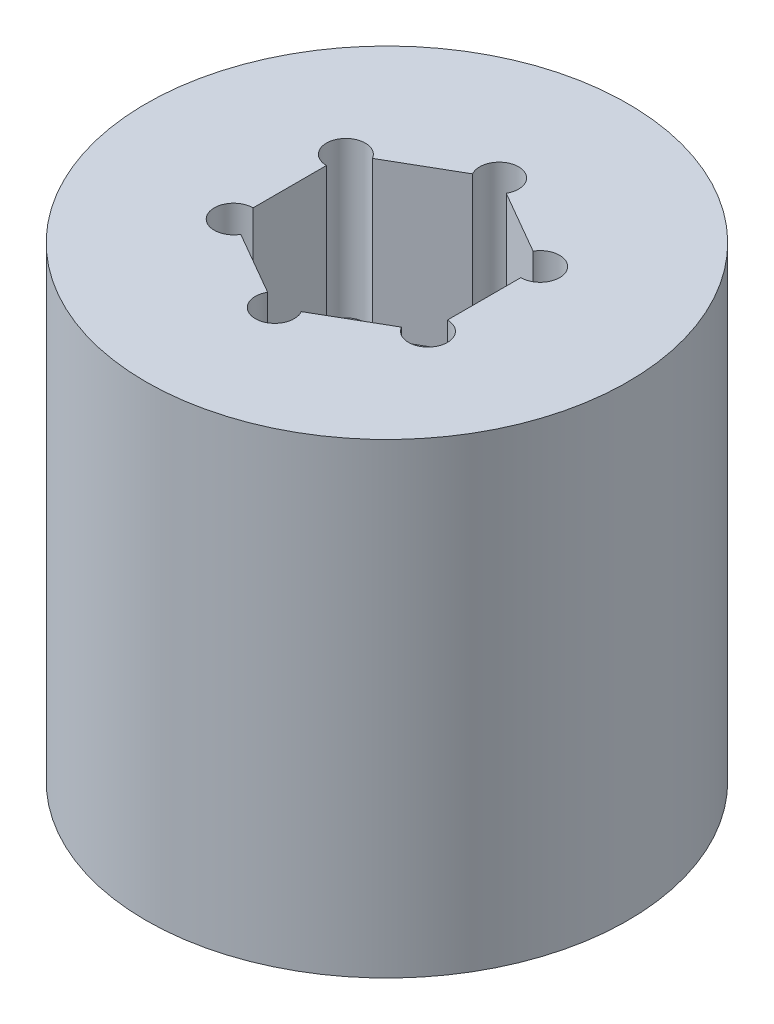
ISO-10303-21;
HEADER;
FILE_DESCRIPTION(('STEP AP214'),'2;1');
FILE_NAME('part.step','',(''),(''),'','','');
FILE_SCHEMA(('AUTOMOTIVE_DESIGN { 1 0 10303 214 1 1 1 1 }'));
ENDSEC;
DATA;
#1=APPLICATION_CONTEXT('core data for automotive mechanical design processes');
#2=APPLICATION_PROTOCOL_DEFINITION('international standard','automotive_design',2000,#1);
#3=PRODUCT_CONTEXT('',#1,'mechanical');
#4=PRODUCT('Part','Part','',(#3));
#5=PRODUCT_RELATED_PRODUCT_CATEGORY('part','',(#4));
#6=PRODUCT_DEFINITION_FORMATION('','',#4);
#7=PRODUCT_DEFINITION_CONTEXT('part definition',#1,'design');
#8=PRODUCT_DEFINITION('design','',#6,#7);
#9=PRODUCT_DEFINITION_SHAPE('','',#8);
#10=(LENGTH_UNIT() NAMED_UNIT(*) SI_UNIT(.MILLI.,.METRE.));
#11=(NAMED_UNIT(*) PLANE_ANGLE_UNIT() SI_UNIT($,.RADIAN.));
#12=(NAMED_UNIT(*) SI_UNIT($,.STERADIAN.) SOLID_ANGLE_UNIT());
#13=UNCERTAINTY_MEASURE_WITH_UNIT(LENGTH_MEASURE(1.E-05),#10,'distance_accuracy_value','');
#14=(GEOMETRIC_REPRESENTATION_CONTEXT(3) GLOBAL_UNCERTAINTY_ASSIGNED_CONTEXT((#13)) GLOBAL_UNIT_ASSIGNED_CONTEXT((#10,
#11,#12)) REPRESENTATION_CONTEXT('',''));
#15=CARTESIAN_POINT('',(0.,0.,0.));
#16=DIRECTION('',(0.,0.,1.));
#17=DIRECTION('',(1.,0.,0.));
#18=AXIS2_PLACEMENT_3D('',#15,#16,#17);
#19=CARTESIAN_POINT('',(0.,19.05,0.));
#20=DIRECTION('',(0.,-1.,0.));
#21=DIRECTION('',(0.,0.,-1.));
#22=AXIS2_PLACEMENT_3D('',#19,#20,#21);
#23=CYLINDRICAL_SURFACE('',#22,19.685);
#24=CARTESIAN_POINT('',(0.,19.05,0.));
#25=DIRECTION('',(0.,1.,0.));
#26=DIRECTION('',(0.,0.,1.));
#27=AXIS2_PLACEMENT_3D('',#24,#25,#26);
#28=CIRCLE('',#27,19.685);
#29=CARTESIAN_POINT('',(0.,19.05,19.685));
#30=VERTEX_POINT('',#29);
#31=EDGE_CURVE('E11',#30,#30,#28,.T.);
#32=ORIENTED_EDGE('',*,*,#31,.F.);
#33=EDGE_LOOP('',(#32));
#34=FACE_BOUND('',#33,.T.);
#35=CARTESIAN_POINT('',(0.,-19.05,0.));
#36=DIRECTION('',(0.,1.,0.));
#37=DIRECTION('',(0.,0.,1.));
#38=AXIS2_PLACEMENT_3D('',#35,#36,#37);
#39=CIRCLE('',#38,19.685);
#40=CARTESIAN_POINT('',(0.,-19.05,19.685));
#41=VERTEX_POINT('',#40);
#42=EDGE_CURVE('E42',#41,#41,#39,.T.);
#43=ORIENTED_EDGE('',*,*,#42,.T.);
#44=EDGE_LOOP('',(#43));
#45=FACE_BOUND('',#44,.T.);
#46=ADVANCED_FACE('F39',(#34,#45),#23,.T.);
#47=CARTESIAN_POINT('',(0.,19.05,0.));
#48=DIRECTION('',(0.,1.,0.));
#49=DIRECTION('',(0.,0.,1.));
#50=AXIS2_PLACEMENT_3D('',#47,#48,#49);
#51=PLANE('',#50);
#52=CARTESIAN_POINT('',(7.9375,19.05,-4.58271776169266));
#53=DIRECTION('',(0.,1.,0.));
#54=DIRECTION('',(0.,0.,1.));
#55=AXIS2_PLACEMENT_3D('',#52,#53,#54);
#56=CIRCLE('',#55,1.5875);
#57=CARTESIAN_POINT('',(7.9375,19.05,-2.99521776169266));
#58=VERTEX_POINT('',#57);
#59=CARTESIAN_POINT('',(6.5626846714922,19.05,-5.37646776169266));
#60=VERTEX_POINT('',#59);
#61=EDGE_CURVE('E54',#58,#60,#56,.T.);
#62=ORIENTED_EDGE('',*,*,#61,.F.);
#63=DIRECTION('',(0.,0.,-1.));
#64=VECTOR('',#63,1.);
#65=CARTESIAN_POINT('',(7.9375,19.05,0.));
#66=LINE('',#65,#64);
#67=CARTESIAN_POINT('',(7.9375,19.05,2.99521776169266));
#68=VERTEX_POINT('',#67);
#69=EDGE_CURVE('E200',#68,#58,#66,.T.);
#70=ORIENTED_EDGE('',*,*,#69,.F.);
#71=CARTESIAN_POINT('',(7.9375,19.05,4.58271776169266));
#72=DIRECTION('',(0.,1.,0.));
#73=DIRECTION('',(0.,0.,1.));
#74=AXIS2_PLACEMENT_3D('',#71,#72,#73);
#75=CIRCLE('',#74,1.5875);
#76=CARTESIAN_POINT('',(6.5626846714922,19.05,5.37646776169266));
#77=VERTEX_POINT('',#76);
#78=EDGE_CURVE('E204',#77,#68,#75,.T.);
#79=ORIENTED_EDGE('',*,*,#78,.F.);
#80=DIRECTION('',(0.866025403784439,0.,-0.5));
#81=VECTOR('',#80,1.);
#82=CARTESIAN_POINT('',(3.96875,19.05,6.87407664253899));
#83=LINE('',#82,#81);
#84=CARTESIAN_POINT('',(1.3748153285078,19.05,8.37168552338531));
#85=VERTEX_POINT('',#84);
#86=EDGE_CURVE('E275',#85,#77,#83,.T.);
#87=ORIENTED_EDGE('',*,*,#86,.F.);
#88=CARTESIAN_POINT('',(0.,19.05,9.16543552338531));
#89=DIRECTION('',(0.,1.,0.));
#90=DIRECTION('',(0.,0.,1.));
#91=AXIS2_PLACEMENT_3D('',#88,#89,#90);
#92=CIRCLE('',#91,1.5875);
#93=CARTESIAN_POINT('',(-1.3748153285078,19.05,8.37168552338531));
#94=VERTEX_POINT('',#93);
#95=EDGE_CURVE('E271',#94,#85,#92,.T.);
#96=ORIENTED_EDGE('',*,*,#95,.F.);
#97=DIRECTION('',(0.866025403784439,0.,0.5));
#98=VECTOR('',#97,1.);
#99=CARTESIAN_POINT('',(-3.96875,19.05,6.87407664253898));
#100=LINE('',#99,#98);
#101=CARTESIAN_POINT('',(-6.5626846714922,19.05,5.37646776169266));
#102=VERTEX_POINT('',#101);
#103=EDGE_CURVE('E267',#102,#94,#100,.T.);
#104=ORIENTED_EDGE('',*,*,#103,.F.);
#105=CARTESIAN_POINT('',(-7.9375,19.05,4.58271776169266));
#106=DIRECTION('',(0.,1.,0.));
#107=DIRECTION('',(0.,0.,1.));
#108=AXIS2_PLACEMENT_3D('',#105,#106,#107);
#109=CIRCLE('',#108,1.5875);
#110=CARTESIAN_POINT('',(-7.9375,19.05,2.99521776169265));
#111=VERTEX_POINT('',#110);
#112=EDGE_CURVE('E263',#111,#102,#109,.T.);
#113=ORIENTED_EDGE('',*,*,#112,.F.);
#114=DIRECTION('',(0.,0.,1.));
#115=VECTOR('',#114,1.);
#116=CARTESIAN_POINT('',(-7.9375,19.05,0.));
#117=LINE('',#116,#115);
#118=CARTESIAN_POINT('',(-7.9375,19.05,-2.99521776169266));
#119=VERTEX_POINT('',#118);
#120=EDGE_CURVE('E259',#119,#111,#117,.T.);
#121=ORIENTED_EDGE('',*,*,#120,.F.);
#122=CARTESIAN_POINT('',(-7.9375,19.05,-4.58271776169266));
#123=DIRECTION('',(0.,1.,0.));
#124=DIRECTION('',(0.,0.,1.));
#125=AXIS2_PLACEMENT_3D('',#122,#123,#124);
#126=CIRCLE('',#125,1.5875);
#127=CARTESIAN_POINT('',(-6.5626846714922,19.05,-5.37646776169266));
#128=VERTEX_POINT('',#127);
#129=EDGE_CURVE('E255',#128,#119,#126,.T.);
#130=ORIENTED_EDGE('',*,*,#129,.F.);
#131=DIRECTION('',(-0.866025403784439,0.,0.5));
#132=VECTOR('',#131,1.);
#133=CARTESIAN_POINT('',(-3.96875,19.05,-6.87407664253898));
#134=LINE('',#133,#132);
#135=CARTESIAN_POINT('',(-1.37481532850779,19.05,-8.37168552338531));
#136=VERTEX_POINT('',#135);
#137=EDGE_CURVE('E251',#136,#128,#134,.T.);
#138=ORIENTED_EDGE('',*,*,#137,.F.);
#139=CARTESIAN_POINT('',(0.,19.05,-9.16543552338531));
#140=DIRECTION('',(0.,1.,0.));
#141=DIRECTION('',(0.,0.,1.));
#142=AXIS2_PLACEMENT_3D('',#139,#140,#141);
#143=CIRCLE('',#142,1.5875);
#144=CARTESIAN_POINT('',(1.3748153285078,19.05,-8.37168552338531));
#145=VERTEX_POINT('',#144);
#146=EDGE_CURVE('E247',#145,#136,#143,.T.);
#147=ORIENTED_EDGE('',*,*,#146,.F.);
#148=DIRECTION('',(-0.866025403784439,0.,-0.5));
#149=VECTOR('',#148,1.);
#150=CARTESIAN_POINT('',(3.96875,19.05,-6.87407664253898));
#151=LINE('',#150,#149);
#152=EDGE_CURVE('E244',#60,#145,#151,.T.);
#153=ORIENTED_EDGE('',*,*,#152,.F.);
#154=EDGE_LOOP('',(#62,#70,#79,#87,#96,#104,#113,#121,#130,#138,#147,#153));
#155=FACE_BOUND('',#154,.T.);
#156=ORIENTED_EDGE('',*,*,#31,.T.);
#157=EDGE_LOOP('',(#156));
#158=FACE_BOUND('',#157,.T.);
#159=ADVANCED_FACE('F443',(#155,#158),#51,.T.);
#160=CARTESIAN_POINT('',(0.,-19.05,0.));
#161=DIRECTION('',(0.,1.,0.));
#162=DIRECTION('',(0.,0.,1.));
#163=AXIS2_PLACEMENT_3D('',#160,#161,#162);
#164=PLANE('',#163);
#165=DIRECTION('',(1.,0.,0.));
#166=VECTOR('',#165,1.);
#167=CARTESIAN_POINT('',(0.,-19.05,-12.7));
#168=LINE('',#167,#166);
#169=CARTESIAN_POINT('',(-11.1125,-19.05,-12.7));
#170=VERTEX_POINT('',#169);
#171=CARTESIAN_POINT('',(11.1125,-19.05,-12.7));
#172=VERTEX_POINT('',#171);
#173=EDGE_CURVE('E348',#170,#172,#168,.T.);
#174=ORIENTED_EDGE('',*,*,#173,.F.);
#175=CARTESIAN_POINT('',(-12.7,-19.05,-12.7));
#176=DIRECTION('',(0.,-1.,0.));
#177=DIRECTION('',(0.,0.,-1.));
#178=AXIS2_PLACEMENT_3D('',#175,#176,#177);
#179=CIRCLE('',#178,1.5875);
#180=CARTESIAN_POINT('',(-12.7,-19.05,-11.1125));
#181=VERTEX_POINT('',#180);
#182=EDGE_CURVE('E62',#181,#170,#179,.T.);
#183=ORIENTED_EDGE('',*,*,#182,.F.);
#184=DIRECTION('',(0.,0.,1.));
#185=VECTOR('',#184,1.);
#186=CARTESIAN_POINT('',(-12.7,-19.05,0.));
#187=LINE('',#186,#185);
#188=CARTESIAN_POINT('',(-12.7,-19.05,11.1125));
#189=VERTEX_POINT('',#188);
#190=EDGE_CURVE('E319',#181,#189,#187,.T.);
#191=ORIENTED_EDGE('',*,*,#190,.T.);
#192=CARTESIAN_POINT('',(-12.7,-19.05,12.7));
#193=DIRECTION('',(0.,-1.,0.));
#194=DIRECTION('',(0.,0.,-1.));
#195=AXIS2_PLACEMENT_3D('',#192,#193,#194);
#196=CIRCLE('',#195,1.5875);
#197=CARTESIAN_POINT('',(-11.1125,-19.05,12.7));
#198=VERTEX_POINT('',#197);
#199=EDGE_CURVE('E368',#198,#189,#196,.T.);
#200=ORIENTED_EDGE('',*,*,#199,.F.);
#201=DIRECTION('',(1.,0.,0.));
#202=VECTOR('',#201,1.);
#203=CARTESIAN_POINT('',(0.,-19.05,12.7));
#204=LINE('',#203,#202);
#205=CARTESIAN_POINT('',(11.1125,-19.05,12.7));
#206=VERTEX_POINT('',#205);
#207=EDGE_CURVE('E364',#198,#206,#204,.T.);
#208=ORIENTED_EDGE('',*,*,#207,.T.);
#209=CARTESIAN_POINT('',(12.7,-19.05,12.7));
#210=DIRECTION('',(0.,-1.,0.));
#211=DIRECTION('',(0.,0.,-1.));
#212=AXIS2_PLACEMENT_3D('',#209,#210,#211);
#213=CIRCLE('',#212,1.5875);
#214=CARTESIAN_POINT('',(12.7,-19.05,11.1125));
#215=VERTEX_POINT('',#214);
#216=EDGE_CURVE('E360',#215,#206,#213,.T.);
#217=ORIENTED_EDGE('',*,*,#216,.F.);
#218=DIRECTION('',(0.,0.,1.));
#219=VECTOR('',#218,1.);
#220=CARTESIAN_POINT('',(12.7,-19.05,0.));
#221=LINE('',#220,#219);
#222=CARTESIAN_POINT('',(12.7,-19.05,-11.1125));
#223=VERTEX_POINT('',#222);
#224=EDGE_CURVE('E356',#223,#215,#221,.T.);
#225=ORIENTED_EDGE('',*,*,#224,.F.);
#226=CARTESIAN_POINT('',(12.7,-19.05,-12.7));
#227=DIRECTION('',(0.,-1.,0.));
#228=DIRECTION('',(0.,0.,-1.));
#229=AXIS2_PLACEMENT_3D('',#226,#227,#228);
#230=CIRCLE('',#229,1.5875);
#231=EDGE_CURVE('E352',#172,#223,#230,.T.);
#232=ORIENTED_EDGE('',*,*,#231,.F.);
#233=EDGE_LOOP('',(#174,#183,#191,#200,#208,#217,#225,#232));
#234=FACE_BOUND('',#233,.T.);
#235=ORIENTED_EDGE('',*,*,#42,.F.);
#236=EDGE_LOOP('',(#235));
#237=FACE_BOUND('',#236,.T.);
#238=ADVANCED_FACE('F404',(#234,#237),#164,.F.);
#239=CARTESIAN_POINT('',(-12.7,0.,-12.7));
#240=DIRECTION('',(0.,-1.,0.));
#241=DIRECTION('',(0.,0.,-1.));
#242=AXIS2_PLACEMENT_3D('',#239,#240,#241);
#243=CYLINDRICAL_SURFACE('',#242,1.5875);
#244=ORIENTED_EDGE('',*,*,#182,.T.);
#245=DIRECTION('',(0.,-1.,0.));
#246=VECTOR('',#245,1.);
#247=CARTESIAN_POINT('',(-11.1125,0.,-12.7));
#248=LINE('',#247,#246);
#249=CARTESIAN_POINT('',(-11.1125,0.,-12.7));
#250=VERTEX_POINT('',#249);
#251=EDGE_CURVE('E345',#250,#170,#248,.T.);
#252=ORIENTED_EDGE('',*,*,#251,.F.);
#253=CARTESIAN_POINT('',(-12.7,0.,-12.7));
#254=DIRECTION('',(0.,-1.,0.));
#255=DIRECTION('',(0.,0.,-1.));
#256=AXIS2_PLACEMENT_3D('',#253,#254,#255);
#257=CIRCLE('',#256,1.5875);
#258=CARTESIAN_POINT('',(-12.7,0.,-11.1125));
#259=VERTEX_POINT('',#258);
#260=EDGE_CURVE('E314',#259,#250,#257,.T.);
#261=ORIENTED_EDGE('',*,*,#260,.F.);
#262=DIRECTION('',(0.,-1.,0.));
#263=VECTOR('',#262,1.);
#264=CARTESIAN_POINT('',(-12.7,0.,-11.1125));
#265=LINE('',#264,#263);
#266=EDGE_CURVE('E375',#259,#181,#265,.T.);
#267=ORIENTED_EDGE('',*,*,#266,.T.);
#268=EDGE_LOOP('',(#244,#252,#261,#267));
#269=FACE_BOUND('',#268,.T.);
#270=ADVANCED_FACE('F415',(#269),#243,.F.);
#271=CARTESIAN_POINT('',(-12.7,0.,0.));
#272=DIRECTION('',(1.,0.,0.));
#273=DIRECTION('',(0.,0.,-1.));
#274=AXIS2_PLACEMENT_3D('',#271,#272,#273);
#275=PLANE('',#274);
#276=ORIENTED_EDGE('',*,*,#190,.F.);
#277=ORIENTED_EDGE('',*,*,#266,.F.);
#278=DIRECTION('',(0.,0.,1.));
#279=VECTOR('',#278,1.);
#280=CARTESIAN_POINT('',(-12.7,0.,0.));
#281=LINE('',#280,#279);
#282=CARTESIAN_POINT('',(-12.7,0.,11.1125));
#283=VERTEX_POINT('',#282);
#284=EDGE_CURVE('E342',#259,#283,#281,.T.);
#285=ORIENTED_EDGE('',*,*,#284,.T.);
#286=DIRECTION('',(0.,-1.,0.));
#287=VECTOR('',#286,1.);
#288=CARTESIAN_POINT('',(-12.7,0.,11.1125));
#289=LINE('',#288,#287);
#290=EDGE_CURVE('E378',#283,#189,#289,.T.);
#291=ORIENTED_EDGE('',*,*,#290,.T.);
#292=EDGE_LOOP('',(#276,#277,#285,#291));
#293=FACE_BOUND('',#292,.T.);
#294=ADVANCED_FACE('F418',(#293),#275,.T.);
#295=CARTESIAN_POINT('',(-12.7,0.,12.7));
#296=DIRECTION('',(0.,-1.,0.));
#297=DIRECTION('',(0.,0.,-1.));
#298=AXIS2_PLACEMENT_3D('',#295,#296,#297);
#299=CYLINDRICAL_SURFACE('',#298,1.5875);
#300=ORIENTED_EDGE('',*,*,#199,.T.);
#301=ORIENTED_EDGE('',*,*,#290,.F.);
#302=CARTESIAN_POINT('',(-12.7,0.,12.7));
#303=DIRECTION('',(0.,-1.,0.));
#304=DIRECTION('',(0.,0.,-1.));
#305=AXIS2_PLACEMENT_3D('',#302,#303,#304);
#306=CIRCLE('',#305,1.5875);
#307=CARTESIAN_POINT('',(-11.1125,0.,12.7));
#308=VERTEX_POINT('',#307);
#309=EDGE_CURVE('E338',#308,#283,#306,.T.);
#310=ORIENTED_EDGE('',*,*,#309,.F.);
#311=DIRECTION('',(0.,-1.,0.));
#312=VECTOR('',#311,1.);
#313=CARTESIAN_POINT('',(-11.1125,0.,12.7));
#314=LINE('',#313,#312);
#315=EDGE_CURVE('E381',#308,#198,#314,.T.);
#316=ORIENTED_EDGE('',*,*,#315,.T.);
#317=EDGE_LOOP('',(#300,#301,#310,#316));
#318=FACE_BOUND('',#317,.T.);
#319=ADVANCED_FACE('F423',(#318),#299,.F.);
#320=CARTESIAN_POINT('',(0.,0.,12.7));
#321=DIRECTION('',(0.,0.,-1.));
#322=DIRECTION('',(-1.,0.,0.));
#323=AXIS2_PLACEMENT_3D('',#320,#321,#322);
#324=PLANE('',#323);
#325=ORIENTED_EDGE('',*,*,#207,.F.);
#326=ORIENTED_EDGE('',*,*,#315,.F.);
#327=DIRECTION('',(1.,0.,0.));
#328=VECTOR('',#327,1.);
#329=CARTESIAN_POINT('',(0.,0.,12.7));
#330=LINE('',#329,#328);
#331=CARTESIAN_POINT('',(11.1125,0.,12.7));
#332=VERTEX_POINT('',#331);
#333=EDGE_CURVE('E335',#308,#332,#330,.T.);
#334=ORIENTED_EDGE('',*,*,#333,.T.);
#335=DIRECTION('',(0.,-1.,0.));
#336=VECTOR('',#335,1.);
#337=CARTESIAN_POINT('',(11.1125,0.,12.7));
#338=LINE('',#337,#336);
#339=EDGE_CURVE('E384',#332,#206,#338,.T.);
#340=ORIENTED_EDGE('',*,*,#339,.T.);
#341=EDGE_LOOP('',(#325,#326,#334,#340));
#342=FACE_BOUND('',#341,.T.);
#343=ADVANCED_FACE('F427',(#342),#324,.T.);
#344=CARTESIAN_POINT('',(12.7,0.,12.7));
#345=DIRECTION('',(0.,-1.,0.));
#346=DIRECTION('',(0.,0.,-1.));
#347=AXIS2_PLACEMENT_3D('',#344,#345,#346);
#348=CYLINDRICAL_SURFACE('',#347,1.5875);
#349=ORIENTED_EDGE('',*,*,#216,.T.);
#350=ORIENTED_EDGE('',*,*,#339,.F.);
#351=CARTESIAN_POINT('',(12.7,0.,12.7));
#352=DIRECTION('',(0.,-1.,0.));
#353=DIRECTION('',(0.,0.,-1.));
#354=AXIS2_PLACEMENT_3D('',#351,#352,#353);
#355=CIRCLE('',#354,1.5875);
#356=CARTESIAN_POINT('',(12.7,0.,11.1125));
#357=VERTEX_POINT('',#356);
#358=EDGE_CURVE('E331',#357,#332,#355,.T.);
#359=ORIENTED_EDGE('',*,*,#358,.F.);
#360=DIRECTION('',(0.,-1.,0.));
#361=VECTOR('',#360,1.);
#362=CARTESIAN_POINT('',(12.7,0.,11.1125));
#363=LINE('',#362,#361);
#364=EDGE_CURVE('E387',#357,#215,#363,.T.);
#365=ORIENTED_EDGE('',*,*,#364,.T.);
#366=EDGE_LOOP('',(#349,#350,#359,#365));
#367=FACE_BOUND('',#366,.T.);
#368=ADVANCED_FACE('F431',(#367),#348,.F.);
#369=CARTESIAN_POINT('',(12.7,0.,0.));
#370=DIRECTION('',(1.,0.,0.));
#371=DIRECTION('',(0.,0.,-1.));
#372=AXIS2_PLACEMENT_3D('',#369,#370,#371);
#373=PLANE('',#372);
#374=ORIENTED_EDGE('',*,*,#224,.T.);
#375=ORIENTED_EDGE('',*,*,#364,.F.);
#376=DIRECTION('',(0.,0.,1.));
#377=VECTOR('',#376,1.);
#378=CARTESIAN_POINT('',(12.7,0.,0.));
#379=LINE('',#378,#377);
#380=CARTESIAN_POINT('',(12.7,0.,-11.1125));
#381=VERTEX_POINT('',#380);
#382=EDGE_CURVE('E327',#381,#357,#379,.T.);
#383=ORIENTED_EDGE('',*,*,#382,.F.);
#384=DIRECTION('',(0.,-1.,0.));
#385=VECTOR('',#384,1.);
#386=CARTESIAN_POINT('',(12.7,0.,-11.1125));
#387=LINE('',#386,#385);
#388=EDGE_CURVE('E390',#381,#223,#387,.T.);
#389=ORIENTED_EDGE('',*,*,#388,.T.);
#390=EDGE_LOOP('',(#374,#375,#383,#389));
#391=FACE_BOUND('',#390,.T.);
#392=ADVANCED_FACE('F433',(#391),#373,.F.);
#393=CARTESIAN_POINT('',(12.7,0.,-12.7));
#394=DIRECTION('',(0.,-1.,0.));
#395=DIRECTION('',(0.,0.,-1.));
#396=AXIS2_PLACEMENT_3D('',#393,#394,#395);
#397=CYLINDRICAL_SURFACE('',#396,1.5875);
#398=ORIENTED_EDGE('',*,*,#231,.T.);
#399=ORIENTED_EDGE('',*,*,#388,.F.);
#400=CARTESIAN_POINT('',(12.7,0.,-12.7));
#401=DIRECTION('',(0.,-1.,0.));
#402=DIRECTION('',(0.,0.,-1.));
#403=AXIS2_PLACEMENT_3D('',#400,#401,#402);
#404=CIRCLE('',#403,1.5875);
#405=CARTESIAN_POINT('',(11.1125,0.,-12.7));
#406=VERTEX_POINT('',#405);
#407=EDGE_CURVE('E323',#406,#381,#404,.T.);
#408=ORIENTED_EDGE('',*,*,#407,.F.);
#409=DIRECTION('',(0.,-1.,0.));
#410=VECTOR('',#409,1.);
#411=CARTESIAN_POINT('',(11.1125,0.,-12.7));
#412=LINE('',#411,#410);
#413=EDGE_CURVE('E393',#406,#172,#412,.T.);
#414=ORIENTED_EDGE('',*,*,#413,.T.);
#415=EDGE_LOOP('',(#398,#399,#408,#414));
#416=FACE_BOUND('',#415,.T.);
#417=ADVANCED_FACE('F409',(#416),#397,.F.);
#418=CARTESIAN_POINT('',(0.,0.,-12.7));
#419=DIRECTION('',(0.,0.,-1.));
#420=DIRECTION('',(-1.,0.,0.));
#421=AXIS2_PLACEMENT_3D('',#418,#419,#420);
#422=PLANE('',#421);
#423=ORIENTED_EDGE('',*,*,#173,.T.);
#424=ORIENTED_EDGE('',*,*,#413,.F.);
#425=DIRECTION('',(1.,0.,0.));
#426=VECTOR('',#425,1.);
#427=CARTESIAN_POINT('',(0.,0.,-12.7));
#428=LINE('',#427,#426);
#429=EDGE_CURVE('E318',#250,#406,#428,.T.);
#430=ORIENTED_EDGE('',*,*,#429,.F.);
#431=ORIENTED_EDGE('',*,*,#251,.T.);
#432=EDGE_LOOP('',(#423,#424,#430,#431));
#433=FACE_BOUND('',#432,.T.);
#434=ADVANCED_FACE('F400',(#433),#422,.F.);
#435=CARTESIAN_POINT('',(0.,0.,0.));
#436=DIRECTION('',(0.,-1.,0.));
#437=DIRECTION('',(0.,0.,-1.));
#438=AXIS2_PLACEMENT_3D('',#435,#436,#437);
#439=PLANE('',#438);
#440=ORIENTED_EDGE('',*,*,#260,.T.);
#441=ORIENTED_EDGE('',*,*,#429,.T.);
#442=ORIENTED_EDGE('',*,*,#407,.T.);
#443=ORIENTED_EDGE('',*,*,#382,.T.);
#444=ORIENTED_EDGE('',*,*,#358,.T.);
#445=ORIENTED_EDGE('',*,*,#333,.F.);
#446=ORIENTED_EDGE('',*,*,#309,.T.);
#447=ORIENTED_EDGE('',*,*,#284,.F.);
#448=EDGE_LOOP('',(#440,#441,#442,#443,#444,#445,#446,#447));
#449=FACE_BOUND('',#448,.T.);
#450=ADVANCED_FACE('F413',(#449),#439,.T.);
#451=CARTESIAN_POINT('',(7.9375,6.35,-4.58271776169266));
#452=DIRECTION('',(0.,1.,0.));
#453=DIRECTION('',(0.,0.,1.));
#454=AXIS2_PLACEMENT_3D('',#451,#452,#453);
#455=CYLINDRICAL_SURFACE('',#454,1.5875);
#456=ORIENTED_EDGE('',*,*,#61,.T.);
#457=DIRECTION('',(0.,1.,0.));
#458=VECTOR('',#457,1.);
#459=CARTESIAN_POINT('',(6.5626846714922,6.35,-5.37646776169266));
#460=LINE('',#459,#458);
#461=CARTESIAN_POINT('',(6.5626846714922,6.35,-5.37646776169266));
#462=VERTEX_POINT('',#461);
#463=EDGE_CURVE('E174',#462,#60,#460,.T.);
#464=ORIENTED_EDGE('',*,*,#463,.F.);
#465=CARTESIAN_POINT('',(7.9375,6.35,-4.58271776169266));
#466=DIRECTION('',(0.,1.,0.));
#467=DIRECTION('',(0.,0.,1.));
#468=AXIS2_PLACEMENT_3D('',#465,#466,#467);
#469=CIRCLE('',#468,1.5875);
#470=CARTESIAN_POINT('',(7.9375,6.35,-2.99521776169266));
#471=VERTEX_POINT('',#470);
#472=EDGE_CURVE('E178',#471,#462,#469,.T.);
#473=ORIENTED_EDGE('',*,*,#472,.F.);
#474=DIRECTION('',(0.,1.,0.));
#475=VECTOR('',#474,1.);
#476=CARTESIAN_POINT('',(7.9375,6.35,-2.99521776169266));
#477=LINE('',#476,#475);
#478=EDGE_CURVE('E282',#471,#58,#477,.T.);
#479=ORIENTED_EDGE('',*,*,#478,.T.);
#480=EDGE_LOOP('',(#456,#464,#473,#479));
#481=FACE_BOUND('',#480,.T.);
#482=ADVANCED_FACE('F176',(#481),#455,.F.);
#483=CARTESIAN_POINT('',(7.9375,6.35,0.));
#484=DIRECTION('',(1.,0.,0.));
#485=DIRECTION('',(0.,0.,-1.));
#486=AXIS2_PLACEMENT_3D('',#483,#484,#485);
#487=PLANE('',#486);
#488=ORIENTED_EDGE('',*,*,#69,.T.);
#489=ORIENTED_EDGE('',*,*,#478,.F.);
#490=DIRECTION('',(0.,0.,-1.));
#491=VECTOR('',#490,1.);
#492=CARTESIAN_POINT('',(7.9375,6.35,0.));
#493=LINE('',#492,#491);
#494=CARTESIAN_POINT('',(7.9375,6.35,2.99521776169266));
#495=VERTEX_POINT('',#494);
#496=EDGE_CURVE('E185',#495,#471,#493,.T.);
#497=ORIENTED_EDGE('',*,*,#496,.F.);
#498=DIRECTION('',(0.,1.,0.));
#499=VECTOR('',#498,1.);
#500=CARTESIAN_POINT('',(7.9375,6.35,2.99521776169266));
#501=LINE('',#500,#499);
#502=EDGE_CURVE('E285',#495,#68,#501,.T.);
#503=ORIENTED_EDGE('',*,*,#502,.T.);
#504=EDGE_LOOP('',(#488,#489,#497,#503));
#505=FACE_BOUND('',#504,.T.);
#506=ADVANCED_FACE('F469',(#505),#487,.F.);
#507=CARTESIAN_POINT('',(7.9375,6.35,4.58271776169266));
#508=DIRECTION('',(0.,1.,0.));
#509=DIRECTION('',(0.,0.,1.));
#510=AXIS2_PLACEMENT_3D('',#507,#508,#509);
#511=CYLINDRICAL_SURFACE('',#510,1.5875);
#512=ORIENTED_EDGE('',*,*,#78,.T.);
#513=ORIENTED_EDGE('',*,*,#502,.F.);
#514=CARTESIAN_POINT('',(7.9375,6.35,4.58271776169266));
#515=DIRECTION('',(0.,1.,0.));
#516=DIRECTION('',(0.,0.,1.));
#517=AXIS2_PLACEMENT_3D('',#514,#515,#516);
#518=CIRCLE('',#517,1.5875);
#519=CARTESIAN_POINT('',(6.5626846714922,6.35,5.37646776169266));
#520=VERTEX_POINT('',#519);
#521=EDGE_CURVE('E237',#520,#495,#518,.T.);
#522=ORIENTED_EDGE('',*,*,#521,.F.);
#523=DIRECTION('',(0.,1.,0.));
#524=VECTOR('',#523,1.);
#525=CARTESIAN_POINT('',(6.5626846714922,6.35,5.37646776169266));
#526=LINE('',#525,#524);
#527=EDGE_CURVE('E288',#520,#77,#526,.T.);
#528=ORIENTED_EDGE('',*,*,#527,.T.);
#529=EDGE_LOOP('',(#512,#513,#522,#528));
#530=FACE_BOUND('',#529,.T.);
#531=ADVANCED_FACE('F529',(#530),#511,.F.);
#532=CARTESIAN_POINT('',(3.96875,6.35,6.87407664253899));
#533=DIRECTION('',(0.5,0.,0.866025403784439));
#534=DIRECTION('',(0.866025403784439,0.,-0.5));
#535=AXIS2_PLACEMENT_3D('',#532,#533,#534);
#536=PLANE('',#535);
#537=ORIENTED_EDGE('',*,*,#86,.T.);
#538=ORIENTED_EDGE('',*,*,#527,.F.);
#539=DIRECTION('',(0.866025403784439,0.,-0.5));
#540=VECTOR('',#539,1.);
#541=CARTESIAN_POINT('',(3.96875,6.35,6.87407664253899));
#542=LINE('',#541,#540);
#543=CARTESIAN_POINT('',(1.3748153285078,6.35,8.37168552338531));
#544=VERTEX_POINT('',#543);
#545=EDGE_CURVE('E233',#544,#520,#542,.T.);
#546=ORIENTED_EDGE('',*,*,#545,.F.);
#547=DIRECTION('',(0.,1.,0.));
#548=VECTOR('',#547,1.);
#549=CARTESIAN_POINT('',(1.3748153285078,6.35,8.37168552338531));
#550=LINE('',#549,#548);
#551=EDGE_CURVE('E291',#544,#85,#550,.T.);
#552=ORIENTED_EDGE('',*,*,#551,.T.);
#553=EDGE_LOOP('',(#537,#538,#546,#552));
#554=FACE_BOUND('',#553,.T.);
#555=ADVANCED_FACE('F539',(#554),#536,.F.);
#556=CARTESIAN_POINT('',(0.,6.35,9.16543552338531));
#557=DIRECTION('',(0.,1.,0.));
#558=DIRECTION('',(0.,0.,1.));
#559=AXIS2_PLACEMENT_3D('',#556,#557,#558);
#560=CYLINDRICAL_SURFACE('',#559,1.5875);
#561=ORIENTED_EDGE('',*,*,#95,.T.);
#562=ORIENTED_EDGE('',*,*,#551,.F.);
#563=CARTESIAN_POINT('',(0.,6.35,9.16543552338531));
#564=DIRECTION('',(0.,1.,0.));
#565=DIRECTION('',(0.,0.,1.));
#566=AXIS2_PLACEMENT_3D('',#563,#564,#565);
#567=CIRCLE('',#566,1.5875);
#568=CARTESIAN_POINT('',(-1.3748153285078,6.35,8.37168552338531));
#569=VERTEX_POINT('',#568);
#570=EDGE_CURVE('E229',#569,#544,#567,.T.);
#571=ORIENTED_EDGE('',*,*,#570,.F.);
#572=DIRECTION('',(0.,1.,0.));
#573=VECTOR('',#572,1.);
#574=CARTESIAN_POINT('',(-1.3748153285078,6.35,8.37168552338531));
#575=LINE('',#574,#573);
#576=EDGE_CURVE('E294',#569,#94,#575,.T.);
#577=ORIENTED_EDGE('',*,*,#576,.T.);
#578=EDGE_LOOP('',(#561,#562,#571,#577));
#579=FACE_BOUND('',#578,.T.);
#580=ADVANCED_FACE('F549',(#579),#560,.F.);
#581=CARTESIAN_POINT('',(-3.96875,6.35,6.87407664253898));
#582=DIRECTION('',(-0.5,0.,0.866025403784439));
#583=DIRECTION('',(0.866025403784439,0.,0.5));
#584=AXIS2_PLACEMENT_3D('',#581,#582,#583);
#585=PLANE('',#584);
#586=ORIENTED_EDGE('',*,*,#103,.T.);
#587=ORIENTED_EDGE('',*,*,#576,.F.);
#588=DIRECTION('',(0.866025403784439,0.,0.5));
#589=VECTOR('',#588,1.);
#590=CARTESIAN_POINT('',(-3.96875,6.35,6.87407664253898));
#591=LINE('',#590,#589);
#592=CARTESIAN_POINT('',(-6.5626846714922,6.35,5.37646776169266));
#593=VERTEX_POINT('',#592);
#594=EDGE_CURVE('E225',#593,#569,#591,.T.);
#595=ORIENTED_EDGE('',*,*,#594,.F.);
#596=DIRECTION('',(0.,1.,0.));
#597=VECTOR('',#596,1.);
#598=CARTESIAN_POINT('',(-6.5626846714922,6.35,5.37646776169266));
#599=LINE('',#598,#597);
#600=EDGE_CURVE('E297',#593,#102,#599,.T.);
#601=ORIENTED_EDGE('',*,*,#600,.T.);
#602=EDGE_LOOP('',(#586,#587,#595,#601));
#603=FACE_BOUND('',#602,.T.);
#604=ADVANCED_FACE('F559',(#603),#585,.F.);
#605=CARTESIAN_POINT('',(-7.9375,6.35,4.58271776169266));
#606=DIRECTION('',(0.,1.,0.));
#607=DIRECTION('',(0.,0.,1.));
#608=AXIS2_PLACEMENT_3D('',#605,#606,#607);
#609=CYLINDRICAL_SURFACE('',#608,1.5875);
#610=ORIENTED_EDGE('',*,*,#112,.T.);
#611=ORIENTED_EDGE('',*,*,#600,.F.);
#612=CARTESIAN_POINT('',(-7.9375,6.35,4.58271776169266));
#613=DIRECTION('',(0.,1.,0.));
#614=DIRECTION('',(0.,0.,1.));
#615=AXIS2_PLACEMENT_3D('',#612,#613,#614);
#616=CIRCLE('',#615,1.5875);
#617=CARTESIAN_POINT('',(-7.9375,6.35,2.99521776169265));
#618=VERTEX_POINT('',#617);
#619=EDGE_CURVE('E221',#618,#593,#616,.T.);
#620=ORIENTED_EDGE('',*,*,#619,.F.);
#621=DIRECTION('',(0.,1.,0.));
#622=VECTOR('',#621,1.);
#623=CARTESIAN_POINT('',(-7.9375,6.35,2.99521776169265));
#624=LINE('',#623,#622);
#625=EDGE_CURVE('E300',#618,#111,#624,.T.);
#626=ORIENTED_EDGE('',*,*,#625,.T.);
#627=EDGE_LOOP('',(#610,#611,#620,#626));
#628=FACE_BOUND('',#627,.T.);
#629=ADVANCED_FACE('F569',(#628),#609,.F.);
#630=CARTESIAN_POINT('',(-7.9375,6.35,0.));
#631=DIRECTION('',(-1.,0.,0.));
#632=DIRECTION('',(0.,0.,1.));
#633=AXIS2_PLACEMENT_3D('',#630,#631,#632);
#634=PLANE('',#633);
#635=ORIENTED_EDGE('',*,*,#120,.T.);
#636=ORIENTED_EDGE('',*,*,#625,.F.);
#637=DIRECTION('',(0.,0.,1.));
#638=VECTOR('',#637,1.);
#639=CARTESIAN_POINT('',(-7.9375,6.35,0.));
#640=LINE('',#639,#638);
#641=CARTESIAN_POINT('',(-7.9375,6.35,-2.99521776169266));
#642=VERTEX_POINT('',#641);
#643=EDGE_CURVE('E217',#642,#618,#640,.T.);
#644=ORIENTED_EDGE('',*,*,#643,.F.);
#645=DIRECTION('',(0.,1.,0.));
#646=VECTOR('',#645,1.);
#647=CARTESIAN_POINT('',(-7.9375,6.35,-2.99521776169266));
#648=LINE('',#647,#646);
#649=EDGE_CURVE('E303',#642,#119,#648,.T.);
#650=ORIENTED_EDGE('',*,*,#649,.T.);
#651=EDGE_LOOP('',(#635,#636,#644,#650));
#652=FACE_BOUND('',#651,.T.);
#653=ADVANCED_FACE('F579',(#652),#634,.F.);
#654=CARTESIAN_POINT('',(-7.9375,6.35,-4.58271776169266));
#655=DIRECTION('',(0.,1.,0.));
#656=DIRECTION('',(0.,0.,1.));
#657=AXIS2_PLACEMENT_3D('',#654,#655,#656);
#658=CYLINDRICAL_SURFACE('',#657,1.5875);
#659=ORIENTED_EDGE('',*,*,#129,.T.);
#660=ORIENTED_EDGE('',*,*,#649,.F.);
#661=CARTESIAN_POINT('',(-7.9375,6.35,-4.58271776169266));
#662=DIRECTION('',(0.,1.,0.));
#663=DIRECTION('',(0.,0.,1.));
#664=AXIS2_PLACEMENT_3D('',#661,#662,#663);
#665=CIRCLE('',#664,1.5875);
#666=CARTESIAN_POINT('',(-6.5626846714922,6.35,-5.37646776169266));
#667=VERTEX_POINT('',#666);
#668=EDGE_CURVE('E213',#667,#642,#665,.T.);
#669=ORIENTED_EDGE('',*,*,#668,.F.);
#670=DIRECTION('',(0.,1.,0.));
#671=VECTOR('',#670,1.);
#672=CARTESIAN_POINT('',(-6.5626846714922,6.35,-5.37646776169266));
#673=LINE('',#672,#671);
#674=EDGE_CURVE('E306',#667,#128,#673,.T.);
#675=ORIENTED_EDGE('',*,*,#674,.T.);
#676=EDGE_LOOP('',(#659,#660,#669,#675));
#677=FACE_BOUND('',#676,.T.);
#678=ADVANCED_FACE('F589',(#677),#658,.F.);
#679=CARTESIAN_POINT('',(-3.96875,6.35,-6.87407664253898));
#680=DIRECTION('',(-0.5,0.,-0.866025403784439));
#681=DIRECTION('',(-0.866025403784439,0.,0.5));
#682=AXIS2_PLACEMENT_3D('',#679,#680,#681);
#683=PLANE('',#682);
#684=ORIENTED_EDGE('',*,*,#137,.T.);
#685=ORIENTED_EDGE('',*,*,#674,.F.);
#686=DIRECTION('',(-0.866025403784439,0.,0.5));
#687=VECTOR('',#686,1.);
#688=CARTESIAN_POINT('',(-3.96875,6.35,-6.87407664253898));
#689=LINE('',#688,#687);
#690=CARTESIAN_POINT('',(-1.37481532850779,6.35,-8.37168552338531));
#691=VERTEX_POINT('',#690);
#692=EDGE_CURVE('E209',#691,#667,#689,.T.);
#693=ORIENTED_EDGE('',*,*,#692,.F.);
#694=DIRECTION('',(0.,1.,0.));
#695=VECTOR('',#694,1.);
#696=CARTESIAN_POINT('',(-1.37481532850779,6.35,-8.37168552338531));
#697=LINE('',#696,#695);
#698=EDGE_CURVE('E309',#691,#136,#697,.T.);
#699=ORIENTED_EDGE('',*,*,#698,.T.);
#700=EDGE_LOOP('',(#684,#685,#693,#699));
#701=FACE_BOUND('',#700,.T.);
#702=ADVANCED_FACE('F599',(#701),#683,.F.);
#703=CARTESIAN_POINT('',(0.,6.35,-9.16543552338531));
#704=DIRECTION('',(0.,1.,0.));
#705=DIRECTION('',(0.,0.,1.));
#706=AXIS2_PLACEMENT_3D('',#703,#704,#705);
#707=CYLINDRICAL_SURFACE('',#706,1.5875);
#708=ORIENTED_EDGE('',*,*,#146,.T.);
#709=ORIENTED_EDGE('',*,*,#698,.F.);
#710=CARTESIAN_POINT('',(0.,6.35,-9.16543552338531));
#711=DIRECTION('',(0.,1.,0.));
#712=DIRECTION('',(0.,0.,1.));
#713=AXIS2_PLACEMENT_3D('',#710,#711,#712);
#714=CIRCLE('',#713,1.5875);
#715=CARTESIAN_POINT('',(1.3748153285078,6.35,-8.37168552338531));
#716=VERTEX_POINT('',#715);
#717=EDGE_CURVE('E194',#716,#691,#714,.T.);
#718=ORIENTED_EDGE('',*,*,#717,.F.);
#719=DIRECTION('',(0.,1.,0.));
#720=VECTOR('',#719,1.);
#721=CARTESIAN_POINT('',(1.3748153285078,6.35,-8.37168552338531));
#722=LINE('',#721,#720);
#723=EDGE_CURVE('E184',#716,#145,#722,.T.);
#724=ORIENTED_EDGE('',*,*,#723,.T.);
#725=EDGE_LOOP('',(#708,#709,#718,#724));
#726=FACE_BOUND('',#725,.T.);
#727=ADVANCED_FACE('F609',(#726),#707,.F.);
#728=CARTESIAN_POINT('',(3.96875,6.35,-6.87407664253898));
#729=DIRECTION('',(0.5,0.,-0.866025403784439));
#730=DIRECTION('',(-0.866025403784439,0.,-0.5));
#731=AXIS2_PLACEMENT_3D('',#728,#729,#730);
#732=PLANE('',#731);
#733=ORIENTED_EDGE('',*,*,#152,.T.);
#734=ORIENTED_EDGE('',*,*,#723,.F.);
#735=DIRECTION('',(-0.866025403784439,0.,-0.5));
#736=VECTOR('',#735,1.);
#737=CARTESIAN_POINT('',(3.96875,6.35,-6.87407664253898));
#738=LINE('',#737,#736);
#739=EDGE_CURVE('E188',#462,#716,#738,.T.);
#740=ORIENTED_EDGE('',*,*,#739,.F.);
#741=ORIENTED_EDGE('',*,*,#463,.T.);
#742=EDGE_LOOP('',(#733,#734,#740,#741));
#743=FACE_BOUND('',#742,.T.);
#744=ADVANCED_FACE('F189',(#743),#732,.F.);
#745=CARTESIAN_POINT('',(0.,6.35,0.));
#746=DIRECTION('',(0.,1.,0.));
#747=DIRECTION('',(0.,0.,1.));
#748=AXIS2_PLACEMENT_3D('',#745,#746,#747);
#749=PLANE('',#748);
#750=ORIENTED_EDGE('',*,*,#472,.T.);
#751=ORIENTED_EDGE('',*,*,#739,.T.);
#752=ORIENTED_EDGE('',*,*,#717,.T.);
#753=ORIENTED_EDGE('',*,*,#692,.T.);
#754=ORIENTED_EDGE('',*,*,#668,.T.);
#755=ORIENTED_EDGE('',*,*,#643,.T.);
#756=ORIENTED_EDGE('',*,*,#619,.T.);
#757=ORIENTED_EDGE('',*,*,#594,.T.);
#758=ORIENTED_EDGE('',*,*,#570,.T.);
#759=ORIENTED_EDGE('',*,*,#545,.T.);
#760=ORIENTED_EDGE('',*,*,#521,.T.);
#761=ORIENTED_EDGE('',*,*,#496,.T.);
#762=EDGE_LOOP('',(#750,#751,#752,#753,#754,#755,#756,#757,#758,#759,#760,#761));
#763=FACE_BOUND('',#762,.T.);
#764=ADVANCED_FACE('F196',(#763),#749,.T.);
#765=CLOSED_SHELL('',(#46,#159,#238,#270,#294,#319,#343,#368,#392,#417,#434,#450,#482,#506,#531,
#555,#580,#604,#629,#653,#678,#702,#727,#744,#764));
#766=MANIFOLD_SOLID_BREP('B2',#765);
#767=ADVANCED_BREP_SHAPE_REPRESENTATION('',(#18,#766),#14);
#768=SHAPE_DEFINITION_REPRESENTATION(#9,#767);
ENDSEC;
END-ISO-10303-21;
